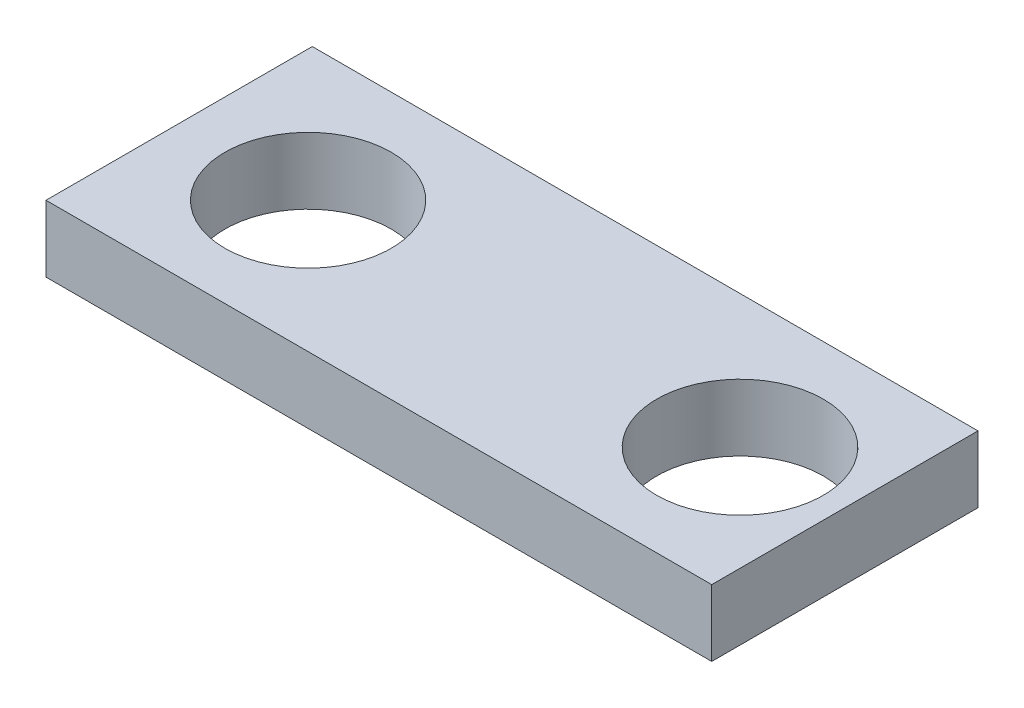
ISO-10303-21;
HEADER;
FILE_DESCRIPTION(('STEP AP214'),'2;1');
FILE_NAME('part.step','',(''),(''),'','','');
FILE_SCHEMA(('AUTOMOTIVE_DESIGN { 1 0 10303 214 1 1 1 1 }'));
ENDSEC;
DATA;
#1=APPLICATION_CONTEXT('core data for automotive mechanical design processes');
#2=APPLICATION_PROTOCOL_DEFINITION('international standard','automotive_design',2000,#1);
#3=PRODUCT_CONTEXT('',#1,'mechanical');
#4=PRODUCT('Part','Part','',(#3));
#5=PRODUCT_RELATED_PRODUCT_CATEGORY('part','',(#4));
#6=PRODUCT_DEFINITION_FORMATION('','',#4);
#7=PRODUCT_DEFINITION_CONTEXT('part definition',#1,'design');
#8=PRODUCT_DEFINITION('design','',#6,#7);
#9=PRODUCT_DEFINITION_SHAPE('','',#8);
#10=(LENGTH_UNIT() NAMED_UNIT(*) SI_UNIT(.MILLI.,.METRE.));
#11=(NAMED_UNIT(*) PLANE_ANGLE_UNIT() SI_UNIT($,.RADIAN.));
#12=(NAMED_UNIT(*) SI_UNIT($,.STERADIAN.) SOLID_ANGLE_UNIT());
#13=UNCERTAINTY_MEASURE_WITH_UNIT(LENGTH_MEASURE(1.E-05),#10,'distance_accuracy_value','');
#14=(GEOMETRIC_REPRESENTATION_CONTEXT(3) GLOBAL_UNCERTAINTY_ASSIGNED_CONTEXT((#13)) GLOBAL_UNIT_ASSIGNED_CONTEXT((#10,
#11,#12)) REPRESENTATION_CONTEXT('',''));
#15=CARTESIAN_POINT('',(0.,0.,0.));
#16=DIRECTION('',(0.,0.,1.));
#17=DIRECTION('',(1.,0.,0.));
#18=AXIS2_PLACEMENT_3D('',#15,#16,#17);
#19=CARTESIAN_POINT('',(0.,12.7,0.));
#20=DIRECTION('',(1.,0.,0.));
#21=DIRECTION('',(0.,0.,-1.));
#22=AXIS2_PLACEMENT_3D('',#19,#20,#21);
#23=PLANE('',#22);
#24=DIRECTION('',(0.,0.,1.));
#25=VECTOR('',#24,1.);
#26=CARTESIAN_POINT('',(0.,0.,0.));
#27=LINE('',#26,#25);
#28=CARTESIAN_POINT('',(0.,0.,-50.8));
#29=VERTEX_POINT('',#28);
#30=CARTESIAN_POINT('',(0.,0.,0.));
#31=VERTEX_POINT('',#30);
#32=EDGE_CURVE('E94',#29,#31,#27,.T.);
#33=ORIENTED_EDGE('',*,*,#32,.T.);
#34=DIRECTION('',(0.,-1.,0.));
#35=VECTOR('',#34,1.);
#36=CARTESIAN_POINT('',(0.,12.7,0.));
#37=LINE('',#36,#35);
#38=CARTESIAN_POINT('',(0.,12.7,0.));
#39=VERTEX_POINT('',#38);
#40=EDGE_CURVE('E11',#39,#31,#37,.T.);
#41=ORIENTED_EDGE('',*,*,#40,.F.);
#42=DIRECTION('',(0.,0.,1.));
#43=VECTOR('',#42,1.);
#44=CARTESIAN_POINT('',(0.,12.7,0.));
#45=LINE('',#44,#43);
#46=CARTESIAN_POINT('',(0.,12.7,-50.8));
#47=VERTEX_POINT('',#46);
#48=EDGE_CURVE('E82',#47,#39,#45,.T.);
#49=ORIENTED_EDGE('',*,*,#48,.F.);
#50=DIRECTION('',(0.,-1.,0.));
#51=VECTOR('',#50,1.);
#52=CARTESIAN_POINT('',(0.,12.7,-50.8));
#53=LINE('',#52,#51);
#54=EDGE_CURVE('E90',#47,#29,#53,.T.);
#55=ORIENTED_EDGE('',*,*,#54,.T.);
#56=EDGE_LOOP('',(#33,#41,#49,#55));
#57=FACE_BOUND('',#56,.T.);
#58=ADVANCED_FACE('F31',(#57),#23,.F.);
#59=CARTESIAN_POINT('',(0.,12.7,0.));
#60=DIRECTION('',(0.,0.,-1.));
#61=DIRECTION('',(-1.,0.,0.));
#62=AXIS2_PLACEMENT_3D('',#59,#60,#61);
#63=PLANE('',#62);
#64=DIRECTION('',(1.,0.,0.));
#65=VECTOR('',#64,1.);
#66=CARTESIAN_POINT('',(0.,0.,0.));
#67=LINE('',#66,#65);
#68=CARTESIAN_POINT('',(127.,0.,0.));
#69=VERTEX_POINT('',#68);
#70=EDGE_CURVE('E86',#31,#69,#67,.T.);
#71=ORIENTED_EDGE('',*,*,#70,.T.);
#72=DIRECTION('',(0.,-1.,0.));
#73=VECTOR('',#72,1.);
#74=CARTESIAN_POINT('',(127.,12.7,0.));
#75=LINE('',#74,#73);
#76=CARTESIAN_POINT('',(127.,12.7,0.));
#77=VERTEX_POINT('',#76);
#78=EDGE_CURVE('E39',#77,#69,#75,.T.);
#79=ORIENTED_EDGE('',*,*,#78,.F.);
#80=DIRECTION('',(1.,0.,0.));
#81=VECTOR('',#80,1.);
#82=CARTESIAN_POINT('',(0.,12.7,0.));
#83=LINE('',#82,#81);
#84=EDGE_CURVE('E77',#39,#77,#83,.T.);
#85=ORIENTED_EDGE('',*,*,#84,.F.);
#86=ORIENTED_EDGE('',*,*,#40,.T.);
#87=EDGE_LOOP('',(#71,#79,#85,#86));
#88=FACE_BOUND('',#87,.T.);
#89=ADVANCED_FACE('F85',(#88),#63,.F.);
#90=CARTESIAN_POINT('',(127.,12.7,0.));
#91=DIRECTION('',(-1.,0.,0.));
#92=DIRECTION('',(0.,0.,1.));
#93=AXIS2_PLACEMENT_3D('',#90,#91,#92);
#94=PLANE('',#93);
#95=DIRECTION('',(0.,0.,-1.));
#96=VECTOR('',#95,1.);
#97=CARTESIAN_POINT('',(127.,0.,0.));
#98=LINE('',#97,#96);
#99=CARTESIAN_POINT('',(127.,0.,-50.8));
#100=VERTEX_POINT('',#99);
#101=EDGE_CURVE('E64',#69,#100,#98,.T.);
#102=ORIENTED_EDGE('',*,*,#101,.T.);
#103=DIRECTION('',(0.,-1.,0.));
#104=VECTOR('',#103,1.);
#105=CARTESIAN_POINT('',(127.,12.7,-50.8));
#106=LINE('',#105,#104);
#107=CARTESIAN_POINT('',(127.,12.7,-50.8));
#108=VERTEX_POINT('',#107);
#109=EDGE_CURVE('E87',#108,#100,#106,.T.);
#110=ORIENTED_EDGE('',*,*,#109,.F.);
#111=DIRECTION('',(0.,0.,-1.));
#112=VECTOR('',#111,1.);
#113=CARTESIAN_POINT('',(127.,12.7,0.));
#114=LINE('',#113,#112);
#115=EDGE_CURVE('E80',#77,#108,#114,.T.);
#116=ORIENTED_EDGE('',*,*,#115,.F.);
#117=ORIENTED_EDGE('',*,*,#78,.T.);
#118=EDGE_LOOP('',(#102,#110,#116,#117));
#119=FACE_BOUND('',#118,.T.);
#120=ADVANCED_FACE('F88',(#119),#94,.F.);
#121=CARTESIAN_POINT('',(0.,12.7,-50.8));
#122=DIRECTION('',(0.,0.,1.));
#123=DIRECTION('',(1.,0.,0.));
#124=AXIS2_PLACEMENT_3D('',#121,#122,#123);
#125=PLANE('',#124);
#126=DIRECTION('',(-1.,0.,0.));
#127=VECTOR('',#126,1.);
#128=CARTESIAN_POINT('',(0.,0.,-50.8));
#129=LINE('',#128,#127);
#130=EDGE_CURVE('E70',#100,#29,#129,.T.);
#131=ORIENTED_EDGE('',*,*,#130,.T.);
#132=ORIENTED_EDGE('',*,*,#54,.F.);
#133=DIRECTION('',(-1.,0.,0.));
#134=VECTOR('',#133,1.);
#135=CARTESIAN_POINT('',(0.,12.7,-50.8));
#136=LINE('',#135,#134);
#137=EDGE_CURVE('E47',#108,#47,#136,.T.);
#138=ORIENTED_EDGE('',*,*,#137,.F.);
#139=ORIENTED_EDGE('',*,*,#109,.T.);
#140=EDGE_LOOP('',(#131,#132,#138,#139));
#141=FACE_BOUND('',#140,.T.);
#142=ADVANCED_FACE('F102',(#141),#125,.F.);
#143=CARTESIAN_POINT('',(0.,12.7,-50.8));
#144=DIRECTION('',(0.,-1.,0.));
#145=DIRECTION('',(0.,0.,-1.));
#146=AXIS2_PLACEMENT_3D('',#143,#144,#145);
#147=PLANE('',#146);
#148=CARTESIAN_POINT('',(107.,12.7,-25.4));
#149=DIRECTION('',(0.,1.,0.));
#150=DIRECTION('',(0.,0.,1.));
#151=AXIS2_PLACEMENT_3D('',#148,#149,#150);
#152=CIRCLE('',#151,15.9);
#153=CARTESIAN_POINT('',(107.,12.7,-9.5));
#154=VERTEX_POINT('',#153);
#155=EDGE_CURVE('E114',#154,#154,#152,.T.);
#156=ORIENTED_EDGE('',*,*,#155,.F.);
#157=EDGE_LOOP('',(#156));
#158=FACE_BOUND('',#157,.T.);
#159=CARTESIAN_POINT('',(25.,12.7,-25.));
#160=DIRECTION('',(0.,1.,0.));
#161=DIRECTION('',(0.,0.,1.));
#162=AXIS2_PLACEMENT_3D('',#159,#160,#161);
#163=CIRCLE('',#162,15.875);
#164=CARTESIAN_POINT('',(25.,12.7,-9.12500000000001));
#165=VERTEX_POINT('',#164);
#166=EDGE_CURVE('E108',#165,#165,#163,.T.);
#167=ORIENTED_EDGE('',*,*,#166,.F.);
#168=EDGE_LOOP('',(#167));
#169=FACE_BOUND('',#168,.T.);
#170=ORIENTED_EDGE('',*,*,#48,.T.);
#171=ORIENTED_EDGE('',*,*,#84,.T.);
#172=ORIENTED_EDGE('',*,*,#115,.T.);
#173=ORIENTED_EDGE('',*,*,#137,.T.);
#174=EDGE_LOOP('',(#170,#171,#172,#173));
#175=FACE_BOUND('',#174,.T.);
#176=ADVANCED_FACE('F78',(#158,#169,#175),#147,.F.);
#177=CARTESIAN_POINT('',(0.,0.,-50.8));
#178=DIRECTION('',(0.,-1.,0.));
#179=DIRECTION('',(0.,0.,-1.));
#180=AXIS2_PLACEMENT_3D('',#177,#178,#179);
#181=PLANE('',#180);
#182=CARTESIAN_POINT('',(107.,0.,-25.4));
#183=DIRECTION('',(0.,1.,0.));
#184=DIRECTION('',(0.,0.,1.));
#185=AXIS2_PLACEMENT_3D('',#182,#183,#184);
#186=CIRCLE('',#185,15.9);
#187=CARTESIAN_POINT('',(107.,0.,-9.5));
#188=VERTEX_POINT('',#187);
#189=EDGE_CURVE('E111',#188,#188,#186,.T.);
#190=ORIENTED_EDGE('',*,*,#189,.T.);
#191=EDGE_LOOP('',(#190));
#192=FACE_BOUND('',#191,.T.);
#193=CARTESIAN_POINT('',(25.,0.,-25.));
#194=DIRECTION('',(0.,1.,0.));
#195=DIRECTION('',(0.,0.,1.));
#196=AXIS2_PLACEMENT_3D('',#193,#194,#195);
#197=CIRCLE('',#196,15.875);
#198=CARTESIAN_POINT('',(25.,0.,-9.12500000000001));
#199=VERTEX_POINT('',#198);
#200=EDGE_CURVE('E97',#199,#199,#197,.T.);
#201=ORIENTED_EDGE('',*,*,#200,.T.);
#202=EDGE_LOOP('',(#201));
#203=FACE_BOUND('',#202,.T.);
#204=ORIENTED_EDGE('',*,*,#32,.F.);
#205=ORIENTED_EDGE('',*,*,#130,.F.);
#206=ORIENTED_EDGE('',*,*,#101,.F.);
#207=ORIENTED_EDGE('',*,*,#70,.F.);
#208=EDGE_LOOP('',(#204,#205,#206,#207));
#209=FACE_BOUND('',#208,.T.);
#210=ADVANCED_FACE('F105',(#192,#203,#209),#181,.T.);
#211=CARTESIAN_POINT('',(25.,0.,-25.));
#212=DIRECTION('',(0.,1.,0.));
#213=DIRECTION('',(0.,0.,1.));
#214=AXIS2_PLACEMENT_3D('',#211,#212,#213);
#215=CYLINDRICAL_SURFACE('',#214,15.875);
#216=ORIENTED_EDGE('',*,*,#200,.F.);
#217=EDGE_LOOP('',(#216));
#218=FACE_BOUND('',#217,.T.);
#219=ORIENTED_EDGE('',*,*,#166,.T.);
#220=EDGE_LOOP('',(#219));
#221=FACE_BOUND('',#220,.T.);
#222=ADVANCED_FACE('F125',(#218,#221),#215,.F.);
#223=CARTESIAN_POINT('',(107.,0.,-25.4));
#224=DIRECTION('',(0.,1.,0.));
#225=DIRECTION('',(0.,0.,1.));
#226=AXIS2_PLACEMENT_3D('',#223,#224,#225);
#227=CYLINDRICAL_SURFACE('',#226,15.9);
#228=ORIENTED_EDGE('',*,*,#189,.F.);
#229=EDGE_LOOP('',(#228));
#230=FACE_BOUND('',#229,.T.);
#231=ORIENTED_EDGE('',*,*,#155,.T.);
#232=EDGE_LOOP('',(#231));
#233=FACE_BOUND('',#232,.T.);
#234=ADVANCED_FACE('F122',(#230,#233),#227,.F.);
#235=CLOSED_SHELL('',(#58,#89,#120,#142,#176,#210,#222,#234));
#236=MANIFOLD_SOLID_BREP('B2',#235);
#237=ADVANCED_BREP_SHAPE_REPRESENTATION('',(#18,#236),#14);
#238=SHAPE_DEFINITION_REPRESENTATION(#9,#237);
ENDSEC;
END-ISO-10303-21;
